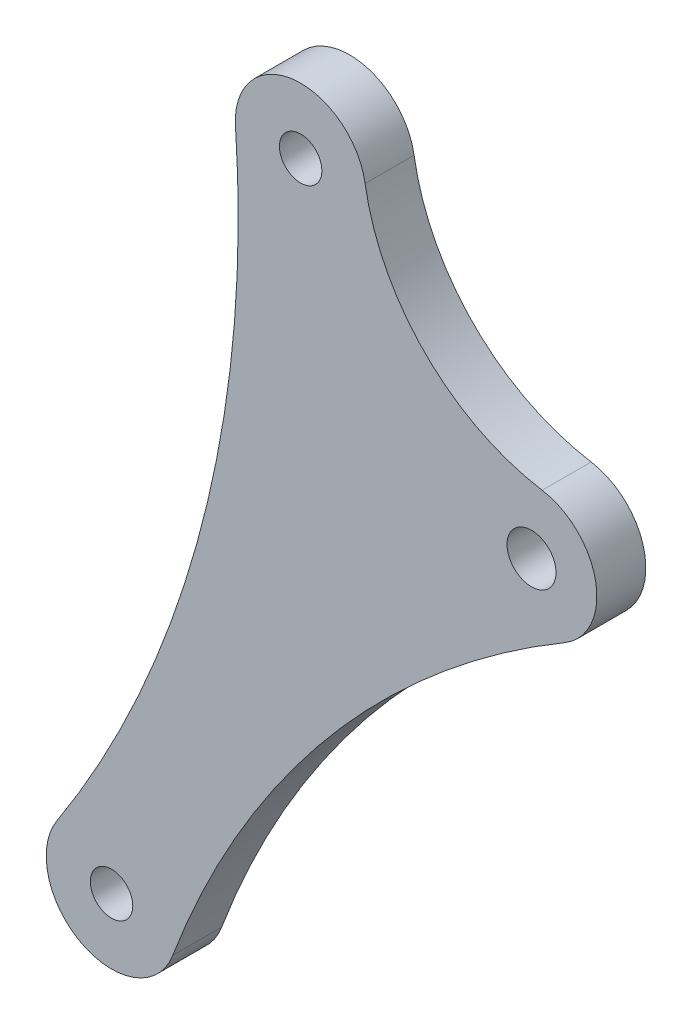
ISO-10303-21;
HEADER;
FILE_DESCRIPTION(('STEP AP214'),'2;1');
FILE_NAME('part.step','',(''),(''),'','','');
FILE_SCHEMA(('AUTOMOTIVE_DESIGN { 1 0 10303 214 1 1 1 1 }'));
ENDSEC;
DATA;
#1=APPLICATION_CONTEXT('core data for automotive mechanical design processes');
#2=APPLICATION_PROTOCOL_DEFINITION('international standard','automotive_design',2000,#1);
#3=PRODUCT_CONTEXT('',#1,'mechanical');
#4=PRODUCT('Part','Part','',(#3));
#5=PRODUCT_RELATED_PRODUCT_CATEGORY('part','',(#4));
#6=PRODUCT_DEFINITION_FORMATION('','',#4);
#7=PRODUCT_DEFINITION_CONTEXT('part definition',#1,'design');
#8=PRODUCT_DEFINITION('design','',#6,#7);
#9=PRODUCT_DEFINITION_SHAPE('','',#8);
#10=(LENGTH_UNIT() NAMED_UNIT(*) SI_UNIT(.MILLI.,.METRE.));
#11=(NAMED_UNIT(*) PLANE_ANGLE_UNIT() SI_UNIT($,.RADIAN.));
#12=(NAMED_UNIT(*) SI_UNIT($,.STERADIAN.) SOLID_ANGLE_UNIT());
#13=UNCERTAINTY_MEASURE_WITH_UNIT(LENGTH_MEASURE(1.E-05),#10,'distance_accuracy_value','');
#14=(GEOMETRIC_REPRESENTATION_CONTEXT(3) GLOBAL_UNCERTAINTY_ASSIGNED_CONTEXT((#13)) GLOBAL_UNIT_ASSIGNED_CONTEXT((#10,
#11,#12)) REPRESENTATION_CONTEXT('',''));
#15=CARTESIAN_POINT('',(0.,0.,0.));
#16=DIRECTION('',(0.,0.,1.));
#17=DIRECTION('',(1.,0.,0.));
#18=AXIS2_PLACEMENT_3D('',#15,#16,#17);
#19=CARTESIAN_POINT('',(69.4978445858682,54.8241334101444,3.));
#20=DIRECTION('',(0.,0.,1.));
#21=DIRECTION('',(1.,0.,0.));
#22=AXIS2_PLACEMENT_3D('',#19,#20,#21);
#23=PLANE('',#22);
#24=CARTESIAN_POINT('',(53.9660453776443,60.5081426591956,3.));
#25=DIRECTION('',(0.,0.,1.));
#26=DIRECTION('',(1.,0.,0.));
#27=AXIS2_PLACEMENT_3D('',#24,#25,#26);
#28=CIRCLE('',#27,1.30000000192308);
#29=CARTESIAN_POINT('',(55.2660453795674,60.5081426591956,3.));
#30=VERTEX_POINT('',#29);
#31=EDGE_CURVE('E184',#30,#30,#28,.T.);
#32=ORIENTED_EDGE('',*,*,#31,.F.);
#33=EDGE_LOOP('',(#32));
#34=FACE_BOUND('',#33,.T.);
#35=CARTESIAN_POINT('',(70.8912561803596,63.2859794316703,3.));
#36=DIRECTION('',(0.,0.,-1.));
#37=DIRECTION('',(1.,0.,0.));
#38=AXIS2_PLACEMENT_3D('',#35,#36,#37);
#39=CIRCLE('',#38,13.1515711894825);
#40=CARTESIAN_POINT('',(68.7544690628221,50.3091552606202,3.));
#41=VERTEX_POINT('',#40);
#42=CARTESIAN_POINT('',(57.9133019740106,61.1560664358106,3.));
#43=VERTEX_POINT('',#42);
#44=EDGE_CURVE('E129',#41,#43,#39,.T.);
#45=ORIENTED_EDGE('',*,*,#44,.T.);
#46=CARTESIAN_POINT('',(53.9662069927437,60.5075152275315,3.));
#47=DIRECTION('',(0.,0.,1.));
#48=DIRECTION('',(1.,0.,0.));
#49=AXIS2_PLACEMENT_3D('',#46,#47,#48);
#50=CIRCLE('',#49,4.00002218255129);
#51=CARTESIAN_POINT('',(49.9759071491593,60.228795620771,3.));
#52=VERTEX_POINT('',#51);
#53=EDGE_CURVE('E87',#43,#52,#50,.T.);
#54=ORIENTED_EDGE('',*,*,#53,.T.);
#55=CARTESIAN_POINT('',(-18.7454801667901,55.4247867214077,3.));
#56=DIRECTION('',(0.,0.,-1.));
#57=DIRECTION('',(1.,0.,0.));
#58=AXIS2_PLACEMENT_3D('',#55,#56,#57);
#59=CIRCLE('',#58,68.8890962063947);
#60=CARTESIAN_POINT('',(39.0302264523894,17.9057875238226,3.));
#61=VERTEX_POINT('',#60);
#62=EDGE_CURVE('E100',#52,#61,#59,.T.);
#63=ORIENTED_EDGE('',*,*,#62,.T.);
#64=CARTESIAN_POINT('',(42.3849484471095,15.7273142117036,3.));
#65=DIRECTION('',(0.,0.,1.));
#66=DIRECTION('',(1.,0.,0.));
#67=AXIS2_PLACEMENT_3D('',#64,#65,#66);
#68=CIRCLE('',#67,3.99998820416678);
#69=CARTESIAN_POINT('',(46.1296648653763,14.3212542626843,3.));
#70=VERTEX_POINT('',#69);
#71=EDGE_CURVE('E94',#61,#70,#68,.T.);
#72=ORIENTED_EDGE('',*,*,#71,.T.);
#73=CARTESIAN_POINT('',(98.6578774360758,-5.40268809695113,3.));
#74=DIRECTION('',(0.,0.,-1.));
#75=DIRECTION('',(1.,0.,0.));
#76=AXIS2_PLACEMENT_3D('',#73,#74,#75);
#77=CIRCLE('',#76,56.109241824131);
#78=CARTESIAN_POINT('',(70.1377254692543,42.9175762842401,3.));
#79=VERTEX_POINT('',#78);
#80=EDGE_CURVE('E98',#70,#79,#77,.T.);
#81=ORIENTED_EDGE('',*,*,#80,.T.);
#82=CARTESIAN_POINT('',(68.1044329913768,46.3622873886184,3.));
#83=DIRECTION('',(0.,0.,1.));
#84=DIRECTION('',(1.,0.,0.));
#85=AXIS2_PLACEMENT_3D('',#82,#83,#84);
#86=CIRCLE('',#85,4.00003911146132);
#87=EDGE_CURVE('E50',#79,#41,#86,.T.);
#88=ORIENTED_EDGE('',*,*,#87,.T.);
#89=EDGE_LOOP('',(#45,#54,#63,#72,#81,#88));
#90=FACE_BOUND('',#89,.T.);
#91=CARTESIAN_POINT('',(42.3849436321098,15.7273448863826,3.));
#92=DIRECTION('',(0.,0.,1.));
#93=DIRECTION('',(1.,0.,0.));
#94=AXIS2_PLACEMENT_3D('',#91,#92,#93);
#95=CIRCLE('',#94,1.30000000192314);
#96=CARTESIAN_POINT('',(43.6849436340329,15.7273448863826,3.));
#97=VERTEX_POINT('',#96);
#98=EDGE_CURVE('E122',#97,#97,#95,.T.);
#99=ORIENTED_EDGE('',*,*,#98,.F.);
#100=EDGE_LOOP('',(#99));
#101=FACE_BOUND('',#100,.T.);
#102=CARTESIAN_POINT('',(68.1045702023388,46.362362270261,3.));
#103=DIRECTION('',(0.,0.,1.));
#104=DIRECTION('',(1.,0.,0.));
#105=AXIS2_PLACEMENT_3D('',#102,#103,#104);
#106=CIRCLE('',#105,1.50000000333314);
#107=CARTESIAN_POINT('',(69.604570205672,46.362362270261,3.));
#108=VERTEX_POINT('',#107);
#109=EDGE_CURVE('E175',#108,#108,#106,.T.);
#110=ORIENTED_EDGE('',*,*,#109,.F.);
#111=EDGE_LOOP('',(#110));
#112=FACE_BOUND('',#111,.T.);
#113=ADVANCED_FACE('F33',(#34,#90,#101,#112),#23,.T.);
#114=CARTESIAN_POINT('',(69.4978445858682,54.8241334101444,0.));
#115=DIRECTION('',(0.,0.,1.));
#116=DIRECTION('',(1.,0.,0.));
#117=AXIS2_PLACEMENT_3D('',#114,#115,#116);
#118=PLANE('',#117);
#119=CARTESIAN_POINT('',(70.8912561803596,63.2859794316703,0.));
#120=DIRECTION('',(0.,0.,-1.));
#121=DIRECTION('',(1.,0.,0.));
#122=AXIS2_PLACEMENT_3D('',#119,#120,#121);
#123=CIRCLE('',#122,13.1515711894825);
#124=CARTESIAN_POINT('',(68.7544690628221,50.3091552606202,0.));
#125=VERTEX_POINT('',#124);
#126=CARTESIAN_POINT('',(57.9133019740106,61.1560664358106,0.));
#127=VERTEX_POINT('',#126);
#128=EDGE_CURVE('E118',#125,#127,#123,.T.);
#129=ORIENTED_EDGE('',*,*,#128,.F.);
#130=CARTESIAN_POINT('',(68.1044329913768,46.3622873886184,0.));
#131=DIRECTION('',(0.,0.,1.));
#132=DIRECTION('',(1.,0.,0.));
#133=AXIS2_PLACEMENT_3D('',#130,#131,#132);
#134=CIRCLE('',#133,4.00003911146132);
#135=CARTESIAN_POINT('',(70.1377254692543,42.9175762842401,0.));
#136=VERTEX_POINT('',#135);
#137=EDGE_CURVE('E79',#136,#125,#134,.T.);
#138=ORIENTED_EDGE('',*,*,#137,.F.);
#139=CARTESIAN_POINT('',(98.6578774360758,-5.40268809695113,0.));
#140=DIRECTION('',(0.,0.,-1.));
#141=DIRECTION('',(1.,0.,0.));
#142=AXIS2_PLACEMENT_3D('',#139,#140,#141);
#143=CIRCLE('',#142,56.109241824131);
#144=CARTESIAN_POINT('',(46.1296648653763,14.3212542626843,0.));
#145=VERTEX_POINT('',#144);
#146=EDGE_CURVE('E73',#145,#136,#143,.T.);
#147=ORIENTED_EDGE('',*,*,#146,.F.);
#148=CARTESIAN_POINT('',(42.3849484471095,15.7273142117036,0.));
#149=DIRECTION('',(0.,0.,1.));
#150=DIRECTION('',(1.,0.,0.));
#151=AXIS2_PLACEMENT_3D('',#148,#149,#150);
#152=CIRCLE('',#151,3.99998820416678);
#153=CARTESIAN_POINT('',(39.0302264523894,17.9057875238226,0.));
#154=VERTEX_POINT('',#153);
#155=EDGE_CURVE('E108',#154,#145,#152,.T.);
#156=ORIENTED_EDGE('',*,*,#155,.F.);
#157=CARTESIAN_POINT('',(-18.7454801667901,55.4247867214077,0.));
#158=DIRECTION('',(0.,0.,-1.));
#159=DIRECTION('',(1.,0.,0.));
#160=AXIS2_PLACEMENT_3D('',#157,#158,#159);
#161=CIRCLE('',#160,68.8890962063947);
#162=CARTESIAN_POINT('',(49.9759071491593,60.228795620771,0.));
#163=VERTEX_POINT('',#162);
#164=EDGE_CURVE('E124',#163,#154,#161,.T.);
#165=ORIENTED_EDGE('',*,*,#164,.F.);
#166=CARTESIAN_POINT('',(53.9662069927437,60.5075152275315,0.));
#167=DIRECTION('',(0.,0.,1.));
#168=DIRECTION('',(1.,0.,0.));
#169=AXIS2_PLACEMENT_3D('',#166,#167,#168);
#170=CIRCLE('',#169,4.00002218255129);
#171=EDGE_CURVE('E121',#127,#163,#170,.T.);
#172=ORIENTED_EDGE('',*,*,#171,.F.);
#173=EDGE_LOOP('',(#129,#138,#147,#156,#165,#172));
#174=FACE_BOUND('',#173,.T.);
#175=CARTESIAN_POINT('',(42.3849436321098,15.7273448863826,0.));
#176=DIRECTION('',(0.,0.,1.));
#177=DIRECTION('',(1.,0.,0.));
#178=AXIS2_PLACEMENT_3D('',#175,#176,#177);
#179=CIRCLE('',#178,1.30000000192314);
#180=CARTESIAN_POINT('',(43.6849436340329,15.7273448863826,0.));
#181=VERTEX_POINT('',#180);
#182=EDGE_CURVE('E187',#181,#181,#179,.T.);
#183=ORIENTED_EDGE('',*,*,#182,.T.);
#184=EDGE_LOOP('',(#183));
#185=FACE_BOUND('',#184,.T.);
#186=CARTESIAN_POINT('',(53.9660453776443,60.5081426591956,0.));
#187=DIRECTION('',(0.,0.,1.));
#188=DIRECTION('',(1.,0.,0.));
#189=AXIS2_PLACEMENT_3D('',#186,#187,#188);
#190=CIRCLE('',#189,1.30000000192308);
#191=CARTESIAN_POINT('',(55.2660453795674,60.5081426591956,0.));
#192=VERTEX_POINT('',#191);
#193=EDGE_CURVE('E181',#192,#192,#190,.T.);
#194=ORIENTED_EDGE('',*,*,#193,.T.);
#195=EDGE_LOOP('',(#194));
#196=FACE_BOUND('',#195,.T.);
#197=CARTESIAN_POINT('',(68.1045702023388,46.362362270261,0.));
#198=DIRECTION('',(0.,0.,1.));
#199=DIRECTION('',(1.,0.,0.));
#200=AXIS2_PLACEMENT_3D('',#197,#198,#199);
#201=CIRCLE('',#200,1.50000000333314);
#202=CARTESIAN_POINT('',(69.604570205672,46.362362270261,0.));
#203=VERTEX_POINT('',#202);
#204=EDGE_CURVE('E178',#203,#203,#201,.T.);
#205=ORIENTED_EDGE('',*,*,#204,.T.);
#206=EDGE_LOOP('',(#205));
#207=FACE_BOUND('',#206,.T.);
#208=ADVANCED_FACE('F138',(#174,#185,#196,#207),#118,.F.);
#209=CARTESIAN_POINT('',(70.8912561803596,63.2859794316703,3.));
#210=DIRECTION('',(0.,0.,-1.));
#211=DIRECTION('',(-1.,0.,0.));
#212=AXIS2_PLACEMENT_3D('',#209,#210,#211);
#213=CYLINDRICAL_SURFACE('',#212,13.1515711894825);
#214=ORIENTED_EDGE('',*,*,#128,.T.);
#215=DIRECTION('',(0.,0.,-1.));
#216=VECTOR('',#215,1.);
#217=CARTESIAN_POINT('',(57.9133019740106,61.1560664358106,3.));
#218=LINE('',#217,#216);
#219=EDGE_CURVE('E11',#43,#127,#218,.T.);
#220=ORIENTED_EDGE('',*,*,#219,.F.);
#221=ORIENTED_EDGE('',*,*,#44,.F.);
#222=DIRECTION('',(0.,0.,-1.));
#223=VECTOR('',#222,1.);
#224=CARTESIAN_POINT('',(68.7544690628221,50.3091552606202,3.));
#225=LINE('',#224,#223);
#226=EDGE_CURVE('E114',#41,#125,#225,.T.);
#227=ORIENTED_EDGE('',*,*,#226,.T.);
#228=EDGE_LOOP('',(#214,#220,#221,#227));
#229=FACE_BOUND('',#228,.T.);
#230=ADVANCED_FACE('F35',(#229),#213,.F.);
#231=CARTESIAN_POINT('',(53.9662069927437,60.5075152275315,3.));
#232=DIRECTION('',(0.,0.,-1.));
#233=DIRECTION('',(-1.,0.,0.));
#234=AXIS2_PLACEMENT_3D('',#231,#232,#233);
#235=CYLINDRICAL_SURFACE('',#234,4.00002218255129);
#236=ORIENTED_EDGE('',*,*,#171,.T.);
#237=DIRECTION('',(0.,0.,-1.));
#238=VECTOR('',#237,1.);
#239=CARTESIAN_POINT('',(49.9759071491593,60.228795620771,3.));
#240=LINE('',#239,#238);
#241=EDGE_CURVE('E42',#52,#163,#240,.T.);
#242=ORIENTED_EDGE('',*,*,#241,.F.);
#243=ORIENTED_EDGE('',*,*,#53,.F.);
#244=ORIENTED_EDGE('',*,*,#219,.T.);
#245=EDGE_LOOP('',(#236,#242,#243,#244));
#246=FACE_BOUND('',#245,.T.);
#247=ADVANCED_FACE('F237',(#246),#235,.T.);
#248=CARTESIAN_POINT('',(-18.7454801667901,55.4247867214077,3.));
#249=DIRECTION('',(0.,0.,-1.));
#250=DIRECTION('',(-1.,0.,0.));
#251=AXIS2_PLACEMENT_3D('',#248,#249,#250);
#252=CYLINDRICAL_SURFACE('',#251,68.8890962063947);
#253=ORIENTED_EDGE('',*,*,#164,.T.);
#254=DIRECTION('',(0.,0.,-1.));
#255=VECTOR('',#254,1.);
#256=CARTESIAN_POINT('',(39.0302264523894,17.9057875238226,3.));
#257=LINE('',#256,#255);
#258=EDGE_CURVE('E109',#61,#154,#257,.T.);
#259=ORIENTED_EDGE('',*,*,#258,.F.);
#260=ORIENTED_EDGE('',*,*,#62,.F.);
#261=ORIENTED_EDGE('',*,*,#241,.T.);
#262=EDGE_LOOP('',(#253,#259,#260,#261));
#263=FACE_BOUND('',#262,.T.);
#264=ADVANCED_FACE('F135',(#263),#252,.F.);
#265=CARTESIAN_POINT('',(42.3849484471095,15.7273142117036,3.));
#266=DIRECTION('',(0.,0.,-1.));
#267=DIRECTION('',(-1.,0.,0.));
#268=AXIS2_PLACEMENT_3D('',#265,#266,#267);
#269=CYLINDRICAL_SURFACE('',#268,3.99998820416678);
#270=ORIENTED_EDGE('',*,*,#155,.T.);
#271=DIRECTION('',(0.,0.,-1.));
#272=VECTOR('',#271,1.);
#273=CARTESIAN_POINT('',(46.1296648653763,14.3212542626843,3.));
#274=LINE('',#273,#272);
#275=EDGE_CURVE('E105',#70,#145,#274,.T.);
#276=ORIENTED_EDGE('',*,*,#275,.F.);
#277=ORIENTED_EDGE('',*,*,#71,.F.);
#278=ORIENTED_EDGE('',*,*,#258,.T.);
#279=EDGE_LOOP('',(#270,#276,#277,#278));
#280=FACE_BOUND('',#279,.T.);
#281=ADVANCED_FACE('F106',(#280),#269,.T.);
#282=CARTESIAN_POINT('',(98.6578774360758,-5.40268809695113,3.));
#283=DIRECTION('',(0.,0.,-1.));
#284=DIRECTION('',(-1.,0.,0.));
#285=AXIS2_PLACEMENT_3D('',#282,#283,#284);
#286=CYLINDRICAL_SURFACE('',#285,56.109241824131);
#287=ORIENTED_EDGE('',*,*,#146,.T.);
#288=DIRECTION('',(0.,0.,-1.));
#289=VECTOR('',#288,1.);
#290=CARTESIAN_POINT('',(70.1377254692543,42.9175762842401,3.));
#291=LINE('',#290,#289);
#292=EDGE_CURVE('E110',#79,#136,#291,.T.);
#293=ORIENTED_EDGE('',*,*,#292,.F.);
#294=ORIENTED_EDGE('',*,*,#80,.F.);
#295=ORIENTED_EDGE('',*,*,#275,.T.);
#296=EDGE_LOOP('',(#287,#293,#294,#295));
#297=FACE_BOUND('',#296,.T.);
#298=ADVANCED_FACE('F112',(#297),#286,.F.);
#299=CARTESIAN_POINT('',(68.1044329913768,46.3622873886184,3.));
#300=DIRECTION('',(0.,0.,-1.));
#301=DIRECTION('',(-1.,0.,0.));
#302=AXIS2_PLACEMENT_3D('',#299,#300,#301);
#303=CYLINDRICAL_SURFACE('',#302,4.00003911146132);
#304=ORIENTED_EDGE('',*,*,#137,.T.);
#305=ORIENTED_EDGE('',*,*,#226,.F.);
#306=ORIENTED_EDGE('',*,*,#87,.F.);
#307=ORIENTED_EDGE('',*,*,#292,.T.);
#308=EDGE_LOOP('',(#304,#305,#306,#307));
#309=FACE_BOUND('',#308,.T.);
#310=ADVANCED_FACE('F143',(#309),#303,.T.);
#311=CARTESIAN_POINT('',(42.3849436321098,15.7273448863826,3.));
#312=DIRECTION('',(0.,0.,-1.));
#313=DIRECTION('',(-1.,0.,0.));
#314=AXIS2_PLACEMENT_3D('',#311,#312,#313);
#315=CYLINDRICAL_SURFACE('',#314,1.30000000192314);
#316=ORIENTED_EDGE('',*,*,#98,.T.);
#317=EDGE_LOOP('',(#316));
#318=FACE_BOUND('',#317,.T.);
#319=ORIENTED_EDGE('',*,*,#182,.F.);
#320=EDGE_LOOP('',(#319));
#321=FACE_BOUND('',#320,.T.);
#322=ADVANCED_FACE('F145',(#318,#321),#315,.F.);
#323=CARTESIAN_POINT('',(53.9660453776443,60.5081426591956,3.));
#324=DIRECTION('',(0.,0.,-1.));
#325=DIRECTION('',(-1.,0.,0.));
#326=AXIS2_PLACEMENT_3D('',#323,#324,#325);
#327=CYLINDRICAL_SURFACE('',#326,1.30000000192308);
#328=ORIENTED_EDGE('',*,*,#31,.T.);
#329=EDGE_LOOP('',(#328));
#330=FACE_BOUND('',#329,.T.);
#331=ORIENTED_EDGE('',*,*,#193,.F.);
#332=EDGE_LOOP('',(#331));
#333=FACE_BOUND('',#332,.T.);
#334=ADVANCED_FACE('F151',(#330,#333),#327,.F.);
#335=CARTESIAN_POINT('',(68.1045702023388,46.362362270261,3.));
#336=DIRECTION('',(0.,0.,-1.));
#337=DIRECTION('',(-1.,0.,0.));
#338=AXIS2_PLACEMENT_3D('',#335,#336,#337);
#339=CYLINDRICAL_SURFACE('',#338,1.50000000333314);
#340=ORIENTED_EDGE('',*,*,#109,.T.);
#341=EDGE_LOOP('',(#340));
#342=FACE_BOUND('',#341,.T.);
#343=ORIENTED_EDGE('',*,*,#204,.F.);
#344=EDGE_LOOP('',(#343));
#345=FACE_BOUND('',#344,.T.);
#346=ADVANCED_FACE('F166',(#342,#345),#339,.F.);
#347=CLOSED_SHELL('',(#113,#208,#230,#247,#264,#281,#298,#310,#322,#334,#346));
#348=MANIFOLD_SOLID_BREP('B2',#347);
#349=ADVANCED_BREP_SHAPE_REPRESENTATION('',(#18,#348),#14);
#350=SHAPE_DEFINITION_REPRESENTATION(#9,#349);
ENDSEC;
END-ISO-10303-21;
